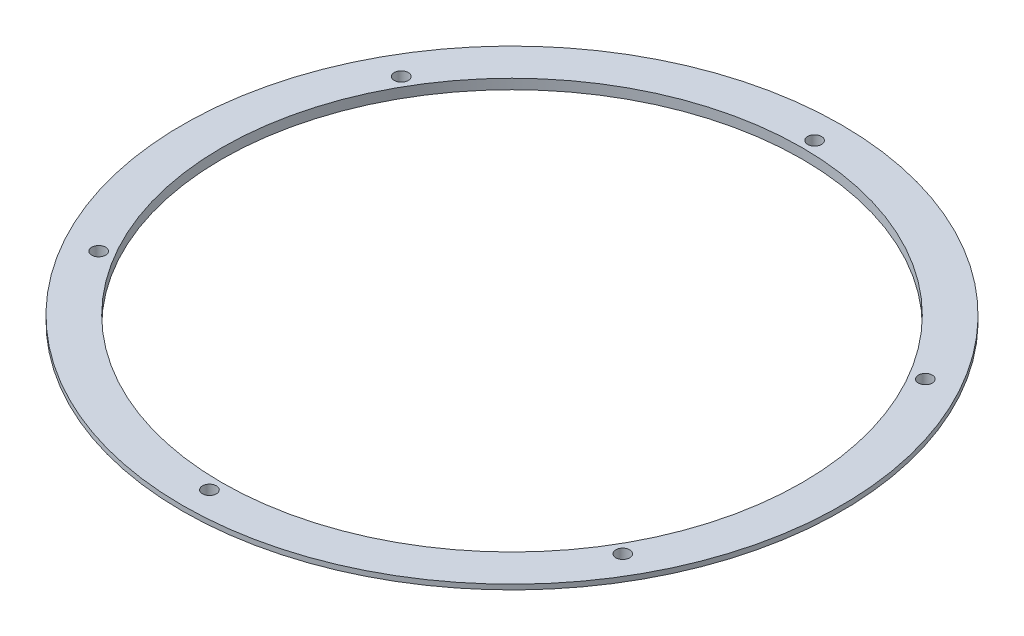
ISO-10303-21;
HEADER;
FILE_DESCRIPTION(('STEP AP214'),'2;1');
FILE_NAME('part.step','',(''),(''),'','','');
FILE_SCHEMA(('AUTOMOTIVE_DESIGN { 1 0 10303 214 1 1 1 1 }'));
ENDSEC;
DATA;
#1=APPLICATION_CONTEXT('core data for automotive mechanical design processes');
#2=APPLICATION_PROTOCOL_DEFINITION('international standard','automotive_design',2000,#1);
#3=PRODUCT_CONTEXT('',#1,'mechanical');
#4=PRODUCT('Part','Part','',(#3));
#5=PRODUCT_RELATED_PRODUCT_CATEGORY('part','',(#4));
#6=PRODUCT_DEFINITION_FORMATION('','',#4);
#7=PRODUCT_DEFINITION_CONTEXT('part definition',#1,'design');
#8=PRODUCT_DEFINITION('design','',#6,#7);
#9=PRODUCT_DEFINITION_SHAPE('','',#8);
#10=(LENGTH_UNIT() NAMED_UNIT(*) SI_UNIT(.MILLI.,.METRE.));
#11=(NAMED_UNIT(*) PLANE_ANGLE_UNIT() SI_UNIT($,.RADIAN.));
#12=(NAMED_UNIT(*) SI_UNIT($,.STERADIAN.) SOLID_ANGLE_UNIT());
#13=UNCERTAINTY_MEASURE_WITH_UNIT(LENGTH_MEASURE(1.E-05),#10,'distance_accuracy_value','');
#14=(GEOMETRIC_REPRESENTATION_CONTEXT(3) GLOBAL_UNCERTAINTY_ASSIGNED_CONTEXT((#13)) GLOBAL_UNIT_ASSIGNED_CONTEXT((#10,
#11,#12)) REPRESENTATION_CONTEXT('',''));
#15=CARTESIAN_POINT('',(0.,0.,0.));
#16=DIRECTION('',(0.,0.,1.));
#17=DIRECTION('',(1.,0.,0.));
#18=AXIS2_PLACEMENT_3D('',#15,#16,#17);
#19=CARTESIAN_POINT('',(0.,5.08,0.));
#20=DIRECTION('',(0.,-1.,0.));
#21=DIRECTION('',(0.,0.,-1.));
#22=AXIS2_PLACEMENT_3D('',#19,#20,#21);
#23=CYLINDRICAL_SURFACE('',#22,160.85);
#24=CARTESIAN_POINT('',(0.,0.,0.));
#25=DIRECTION('',(0.,1.,0.));
#26=DIRECTION('',(0.,0.,1.));
#27=AXIS2_PLACEMENT_3D('',#24,#25,#26);
#28=CIRCLE('',#27,160.85);
#29=CARTESIAN_POINT('',(0.,0.,160.85));
#30=VERTEX_POINT('',#29);
#31=EDGE_CURVE('E48',#30,#30,#28,.T.);
#32=ORIENTED_EDGE('',*,*,#31,.T.);
#33=EDGE_LOOP('',(#32));
#34=FACE_BOUND('',#33,.T.);
#35=CARTESIAN_POINT('',(0.,2.54,0.));
#36=DIRECTION('',(0.,1.,0.));
#37=DIRECTION('',(0.,0.,1.));
#38=AXIS2_PLACEMENT_3D('',#35,#36,#37);
#39=CIRCLE('',#38,160.85);
#40=CARTESIAN_POINT('',(0.,2.54,160.85));
#41=VERTEX_POINT('',#40);
#42=EDGE_CURVE('E10',#41,#41,#39,.T.);
#43=ORIENTED_EDGE('',*,*,#42,.F.);
#44=EDGE_LOOP('',(#43));
#45=FACE_BOUND('',#44,.T.);
#46=ADVANCED_FACE('F41',(#34,#45),#23,.T.);
#47=CARTESIAN_POINT('',(0.,5.08,0.));
#48=DIRECTION('',(0.,1.,0.));
#49=DIRECTION('',(0.,0.,1.));
#50=AXIS2_PLACEMENT_3D('',#47,#48,#49);
#51=PLANE('',#50);
#52=CARTESIAN_POINT('',(-133.800924884691,5.08,-77.2499999999923));
#53=DIRECTION('',(0.,1.,0.));
#54=DIRECTION('',(0.,0.,1.));
#55=AXIS2_PLACEMENT_3D('',#52,#53,#54);
#56=CIRCLE('',#55,3.5560000000082);
#57=CARTESIAN_POINT('',(-133.800924884691,5.08,-73.6939999999841));
#58=VERTEX_POINT('',#57);
#59=EDGE_CURVE('E93',#58,#58,#56,.T.);
#60=ORIENTED_EDGE('',*,*,#59,.F.);
#61=EDGE_LOOP('',(#60));
#62=FACE_BOUND('',#61,.T.);
#63=CARTESIAN_POINT('',(1.75078540488492E-11,5.08,154.5));
#64=DIRECTION('',(0.,1.,0.));
#65=DIRECTION('',(0.,0.,1.));
#66=AXIS2_PLACEMENT_3D('',#63,#64,#65);
#67=CIRCLE('',#66,3.55600000001777);
#68=CARTESIAN_POINT('',(1.75078540488492E-11,5.08,158.056000000018));
#69=VERTEX_POINT('',#68);
#70=EDGE_CURVE('E77',#69,#69,#67,.T.);
#71=ORIENTED_EDGE('',*,*,#70,.F.);
#72=EDGE_LOOP('',(#71));
#73=FACE_BOUND('',#72,.T.);
#74=CARTESIAN_POINT('',(133.8009248847,5.08,-77.2500000000076));
#75=DIRECTION('',(0.,1.,0.));
#76=DIRECTION('',(0.,0.,1.));
#77=AXIS2_PLACEMENT_3D('',#74,#75,#76);
#78=CIRCLE('',#77,3.55600000000233);
#79=CARTESIAN_POINT('',(133.8009248847,5.08,-73.6940000000053));
#80=VERTEX_POINT('',#79);
#81=EDGE_CURVE('E63',#80,#80,#78,.T.);
#82=ORIENTED_EDGE('',*,*,#81,.F.);
#83=EDGE_LOOP('',(#82));
#84=FACE_BOUND('',#83,.T.);
#85=CARTESIAN_POINT('',(0.,5.08,-154.5));
#86=DIRECTION('',(0.,1.,0.));
#87=DIRECTION('',(0.,0.,1.));
#88=AXIS2_PLACEMENT_3D('',#85,#86,#87);
#89=CIRCLE('',#88,3.556);
#90=CARTESIAN_POINT('',(0.,5.08,-150.944));
#91=VERTEX_POINT('',#90);
#92=EDGE_CURVE('E53',#91,#91,#89,.T.);
#93=ORIENTED_EDGE('',*,*,#92,.F.);
#94=EDGE_LOOP('',(#93));
#95=FACE_BOUND('',#94,.T.);
#96=CARTESIAN_POINT('',(133.800924884709,5.08,77.2499999999924));
#97=DIRECTION('',(0.,1.,0.));
#98=DIRECTION('',(0.,0.,1.));
#99=AXIS2_PLACEMENT_3D('',#96,#97,#98);
#100=CIRCLE('',#99,3.55600000001105);
#101=CARTESIAN_POINT('',(133.800924884709,5.08,80.8060000000035));
#102=VERTEX_POINT('',#101);
#103=EDGE_CURVE('E69',#102,#102,#100,.T.);
#104=ORIENTED_EDGE('',*,*,#103,.F.);
#105=EDGE_LOOP('',(#104));
#106=FACE_BOUND('',#105,.T.);
#107=CARTESIAN_POINT('',(-133.800924884683,5.08,77.2500000000076));
#108=DIRECTION('',(0.,1.,0.));
#109=DIRECTION('',(0.,0.,1.));
#110=AXIS2_PLACEMENT_3D('',#107,#108,#109);
#111=CIRCLE('',#110,3.55600000001622);
#112=CARTESIAN_POINT('',(-133.800924884683,5.08,80.8060000000239));
#113=VERTEX_POINT('',#112);
#114=EDGE_CURVE('E85',#113,#113,#111,.T.);
#115=ORIENTED_EDGE('',*,*,#114,.F.);
#116=EDGE_LOOP('',(#115));
#117=FACE_BOUND('',#116,.T.);
#118=CARTESIAN_POINT('',(0.,5.08,0.));
#119=DIRECTION('',(0.,1.,0.));
#120=DIRECTION('',(0.,0.,1.));
#121=AXIS2_PLACEMENT_3D('',#118,#119,#120);
#122=CIRCLE('',#121,148.15);
#123=CARTESIAN_POINT('',(0.,5.08,148.15));
#124=VERTEX_POINT('',#123);
#125=EDGE_CURVE('E101',#124,#124,#122,.T.);
#126=ORIENTED_EDGE('',*,*,#125,.F.);
#127=EDGE_LOOP('',(#126));
#128=FACE_BOUND('',#127,.T.);
#129=CARTESIAN_POINT('',(0.,5.08,0.));
#130=DIRECTION('',(0.,1.,0.));
#131=DIRECTION('',(0.,0.,1.));
#132=AXIS2_PLACEMENT_3D('',#129,#130,#131);
#133=CIRCLE('',#132,168.275);
#134=CARTESIAN_POINT('',(0.,5.08,168.275));
#135=VERTEX_POINT('',#134);
#136=EDGE_CURVE('E113',#135,#135,#133,.T.);
#137=ORIENTED_EDGE('',*,*,#136,.T.);
#138=EDGE_LOOP('',(#137));
#139=FACE_BOUND('',#138,.T.);
#140=ADVANCED_FACE('F133',(#62,#73,#84,#95,#106,#117,#128,#139),#51,.T.);
#141=CARTESIAN_POINT('',(0.,0.,0.));
#142=DIRECTION('',(0.,1.,0.));
#143=DIRECTION('',(0.,0.,1.));
#144=AXIS2_PLACEMENT_3D('',#141,#142,#143);
#145=PLANE('',#144);
#146=ORIENTED_EDGE('',*,*,#31,.F.);
#147=EDGE_LOOP('',(#146));
#148=FACE_BOUND('',#147,.T.);
#149=CARTESIAN_POINT('',(0.,0.,-154.5));
#150=DIRECTION('',(0.,1.,0.));
#151=DIRECTION('',(0.,0.,1.));
#152=AXIS2_PLACEMENT_3D('',#149,#150,#151);
#153=CIRCLE('',#152,3.556);
#154=CARTESIAN_POINT('',(0.,0.,-150.944));
#155=VERTEX_POINT('',#154);
#156=EDGE_CURVE('E58',#155,#155,#153,.T.);
#157=ORIENTED_EDGE('',*,*,#156,.T.);
#158=EDGE_LOOP('',(#157));
#159=FACE_BOUND('',#158,.T.);
#160=CARTESIAN_POINT('',(133.8009248847,0.,-77.2500000000076));
#161=DIRECTION('',(0.,1.,0.));
#162=DIRECTION('',(0.,0.,1.));
#163=AXIS2_PLACEMENT_3D('',#160,#161,#162);
#164=CIRCLE('',#163,3.55600000000233);
#165=CARTESIAN_POINT('',(133.8009248847,0.,-73.6940000000053));
#166=VERTEX_POINT('',#165);
#167=EDGE_CURVE('E65',#166,#166,#164,.T.);
#168=ORIENTED_EDGE('',*,*,#167,.T.);
#169=EDGE_LOOP('',(#168));
#170=FACE_BOUND('',#169,.T.);
#171=CARTESIAN_POINT('',(133.800924884709,0.,77.2499999999924));
#172=DIRECTION('',(0.,1.,0.));
#173=DIRECTION('',(0.,0.,1.));
#174=AXIS2_PLACEMENT_3D('',#171,#172,#173);
#175=CIRCLE('',#174,3.55600000001105);
#176=CARTESIAN_POINT('',(133.800924884709,0.,80.8060000000035));
#177=VERTEX_POINT('',#176);
#178=EDGE_CURVE('E73',#177,#177,#175,.T.);
#179=ORIENTED_EDGE('',*,*,#178,.T.);
#180=EDGE_LOOP('',(#179));
#181=FACE_BOUND('',#180,.T.);
#182=CARTESIAN_POINT('',(1.75078540488492E-11,0.,154.5));
#183=DIRECTION('',(0.,1.,0.));
#184=DIRECTION('',(0.,0.,1.));
#185=AXIS2_PLACEMENT_3D('',#182,#183,#184);
#186=CIRCLE('',#185,3.55600000001777);
#187=CARTESIAN_POINT('',(1.75078540488492E-11,0.,158.056000000018));
#188=VERTEX_POINT('',#187);
#189=EDGE_CURVE('E81',#188,#188,#186,.T.);
#190=ORIENTED_EDGE('',*,*,#189,.T.);
#191=EDGE_LOOP('',(#190));
#192=FACE_BOUND('',#191,.T.);
#193=CARTESIAN_POINT('',(-133.800924884683,0.,77.2500000000076));
#194=DIRECTION('',(0.,1.,0.));
#195=DIRECTION('',(0.,0.,1.));
#196=AXIS2_PLACEMENT_3D('',#193,#194,#195);
#197=CIRCLE('',#196,3.55600000001622);
#198=CARTESIAN_POINT('',(-133.800924884683,0.,80.8060000000239));
#199=VERTEX_POINT('',#198);
#200=EDGE_CURVE('E89',#199,#199,#197,.T.);
#201=ORIENTED_EDGE('',*,*,#200,.T.);
#202=EDGE_LOOP('',(#201));
#203=FACE_BOUND('',#202,.T.);
#204=CARTESIAN_POINT('',(-133.800924884691,0.,-77.2499999999923));
#205=DIRECTION('',(0.,1.,0.));
#206=DIRECTION('',(0.,0.,1.));
#207=AXIS2_PLACEMENT_3D('',#204,#205,#206);
#208=CIRCLE('',#207,3.5560000000082);
#209=CARTESIAN_POINT('',(-133.800924884691,0.,-73.6939999999841));
#210=VERTEX_POINT('',#209);
#211=EDGE_CURVE('E97',#210,#210,#208,.T.);
#212=ORIENTED_EDGE('',*,*,#211,.T.);
#213=EDGE_LOOP('',(#212));
#214=FACE_BOUND('',#213,.T.);
#215=CARTESIAN_POINT('',(0.,0.,0.));
#216=DIRECTION('',(0.,1.,0.));
#217=DIRECTION('',(0.,0.,1.));
#218=AXIS2_PLACEMENT_3D('',#215,#216,#217);
#219=CIRCLE('',#218,148.15);
#220=CARTESIAN_POINT('',(0.,0.,148.15));
#221=VERTEX_POINT('',#220);
#222=EDGE_CURVE('E105',#221,#221,#219,.T.);
#223=ORIENTED_EDGE('',*,*,#222,.T.);
#224=EDGE_LOOP('',(#223));
#225=FACE_BOUND('',#224,.T.);
#226=ADVANCED_FACE('F137',(#148,#159,#170,#181,#192,#203,#214,#225),#145,.F.);
#227=CARTESIAN_POINT('',(0.,5.08,-154.5));
#228=DIRECTION('',(0.,-1.,0.));
#229=DIRECTION('',(0.,0.,-1.));
#230=AXIS2_PLACEMENT_3D('',#227,#228,#229);
#231=CYLINDRICAL_SURFACE('',#230,3.556);
#232=ORIENTED_EDGE('',*,*,#92,.T.);
#233=EDGE_LOOP('',(#232));
#234=FACE_BOUND('',#233,.T.);
#235=ORIENTED_EDGE('',*,*,#156,.F.);
#236=EDGE_LOOP('',(#235));
#237=FACE_BOUND('',#236,.T.);
#238=ADVANCED_FACE('F144',(#234,#237),#231,.F.);
#239=CARTESIAN_POINT('',(133.8009248847,5.08,-77.2500000000076));
#240=DIRECTION('',(0.,-1.,0.));
#241=DIRECTION('',(0.,0.,-1.));
#242=AXIS2_PLACEMENT_3D('',#239,#240,#241);
#243=CYLINDRICAL_SURFACE('',#242,3.55600000000233);
#244=ORIENTED_EDGE('',*,*,#81,.T.);
#245=EDGE_LOOP('',(#244));
#246=FACE_BOUND('',#245,.T.);
#247=ORIENTED_EDGE('',*,*,#167,.F.);
#248=EDGE_LOOP('',(#247));
#249=FACE_BOUND('',#248,.T.);
#250=ADVANCED_FACE('F151',(#246,#249),#243,.F.);
#251=CARTESIAN_POINT('',(133.800924884709,5.08,77.2499999999924));
#252=DIRECTION('',(0.,-1.,0.));
#253=DIRECTION('',(0.,0.,-1.));
#254=AXIS2_PLACEMENT_3D('',#251,#252,#253);
#255=CYLINDRICAL_SURFACE('',#254,3.55600000001105);
#256=ORIENTED_EDGE('',*,*,#103,.T.);
#257=EDGE_LOOP('',(#256));
#258=FACE_BOUND('',#257,.T.);
#259=ORIENTED_EDGE('',*,*,#178,.F.);
#260=EDGE_LOOP('',(#259));
#261=FACE_BOUND('',#260,.T.);
#262=ADVANCED_FACE('F155',(#258,#261),#255,.F.);
#263=CARTESIAN_POINT('',(1.75078540488492E-11,5.08,154.5));
#264=DIRECTION('',(0.,-1.,0.));
#265=DIRECTION('',(0.,0.,-1.));
#266=AXIS2_PLACEMENT_3D('',#263,#264,#265);
#267=CYLINDRICAL_SURFACE('',#266,3.55600000001777);
#268=ORIENTED_EDGE('',*,*,#70,.T.);
#269=EDGE_LOOP('',(#268));
#270=FACE_BOUND('',#269,.T.);
#271=ORIENTED_EDGE('',*,*,#189,.F.);
#272=EDGE_LOOP('',(#271));
#273=FACE_BOUND('',#272,.T.);
#274=ADVANCED_FACE('F159',(#270,#273),#267,.F.);
#275=CARTESIAN_POINT('',(-133.800924884683,5.08,77.2500000000076));
#276=DIRECTION('',(0.,-1.,0.));
#277=DIRECTION('',(0.,0.,-1.));
#278=AXIS2_PLACEMENT_3D('',#275,#276,#277);
#279=CYLINDRICAL_SURFACE('',#278,3.55600000001622);
#280=ORIENTED_EDGE('',*,*,#114,.T.);
#281=EDGE_LOOP('',(#280));
#282=FACE_BOUND('',#281,.T.);
#283=ORIENTED_EDGE('',*,*,#200,.F.);
#284=EDGE_LOOP('',(#283));
#285=FACE_BOUND('',#284,.T.);
#286=ADVANCED_FACE('F163',(#282,#285),#279,.F.);
#287=CARTESIAN_POINT('',(-133.800924884691,5.08,-77.2499999999923));
#288=DIRECTION('',(0.,-1.,0.));
#289=DIRECTION('',(0.,0.,-1.));
#290=AXIS2_PLACEMENT_3D('',#287,#288,#289);
#291=CYLINDRICAL_SURFACE('',#290,3.5560000000082);
#292=ORIENTED_EDGE('',*,*,#59,.T.);
#293=EDGE_LOOP('',(#292));
#294=FACE_BOUND('',#293,.T.);
#295=ORIENTED_EDGE('',*,*,#211,.F.);
#296=EDGE_LOOP('',(#295));
#297=FACE_BOUND('',#296,.T.);
#298=ADVANCED_FACE('F167',(#294,#297),#291,.F.);
#299=CARTESIAN_POINT('',(0.,5.08,0.));
#300=DIRECTION('',(0.,-1.,0.));
#301=DIRECTION('',(0.,0.,-1.));
#302=AXIS2_PLACEMENT_3D('',#299,#300,#301);
#303=CYLINDRICAL_SURFACE('',#302,148.15);
#304=ORIENTED_EDGE('',*,*,#125,.T.);
#305=EDGE_LOOP('',(#304));
#306=FACE_BOUND('',#305,.T.);
#307=ORIENTED_EDGE('',*,*,#222,.F.);
#308=EDGE_LOOP('',(#307));
#309=FACE_BOUND('',#308,.T.);
#310=ADVANCED_FACE('F130',(#306,#309),#303,.F.);
#311=CARTESIAN_POINT('',(0.,2.54,0.));
#312=DIRECTION('',(0.,1.,0.));
#313=DIRECTION('',(0.,0.,1.));
#314=AXIS2_PLACEMENT_3D('',#311,#312,#313);
#315=CYLINDRICAL_SURFACE('',#314,168.275);
#316=CARTESIAN_POINT('',(0.,2.54,0.));
#317=DIRECTION('',(0.,1.,0.));
#318=DIRECTION('',(0.,0.,1.));
#319=AXIS2_PLACEMENT_3D('',#316,#317,#318);
#320=CIRCLE('',#319,168.275);
#321=CARTESIAN_POINT('',(0.,2.54,168.275));
#322=VERTEX_POINT('',#321);
#323=EDGE_CURVE('E109',#322,#322,#320,.T.);
#324=ORIENTED_EDGE('',*,*,#323,.T.);
#325=EDGE_LOOP('',(#324));
#326=FACE_BOUND('',#325,.T.);
#327=ORIENTED_EDGE('',*,*,#136,.F.);
#328=EDGE_LOOP('',(#327));
#329=FACE_BOUND('',#328,.T.);
#330=ADVANCED_FACE('F121',(#326,#329),#315,.T.);
#331=CARTESIAN_POINT('',(0.,2.54,0.));
#332=DIRECTION('',(0.,1.,0.));
#333=DIRECTION('',(0.,0.,1.));
#334=AXIS2_PLACEMENT_3D('',#331,#332,#333);
#335=PLANE('',#334);
#336=ORIENTED_EDGE('',*,*,#42,.T.);
#337=EDGE_LOOP('',(#336));
#338=FACE_BOUND('',#337,.T.);
#339=ORIENTED_EDGE('',*,*,#323,.F.);
#340=EDGE_LOOP('',(#339));
#341=FACE_BOUND('',#340,.T.);
#342=ADVANCED_FACE('F124',(#338,#341),#335,.F.);
#343=CLOSED_SHELL('',(#46,#140,#226,#238,#250,#262,#274,#286,#298,#310,#330,#342));
#344=MANIFOLD_SOLID_BREP('B2',#343);
#345=ADVANCED_BREP_SHAPE_REPRESENTATION('',(#18,#344),#14);
#346=SHAPE_DEFINITION_REPRESENTATION(#9,#345);
ENDSEC;
END-ISO-10303-21;
